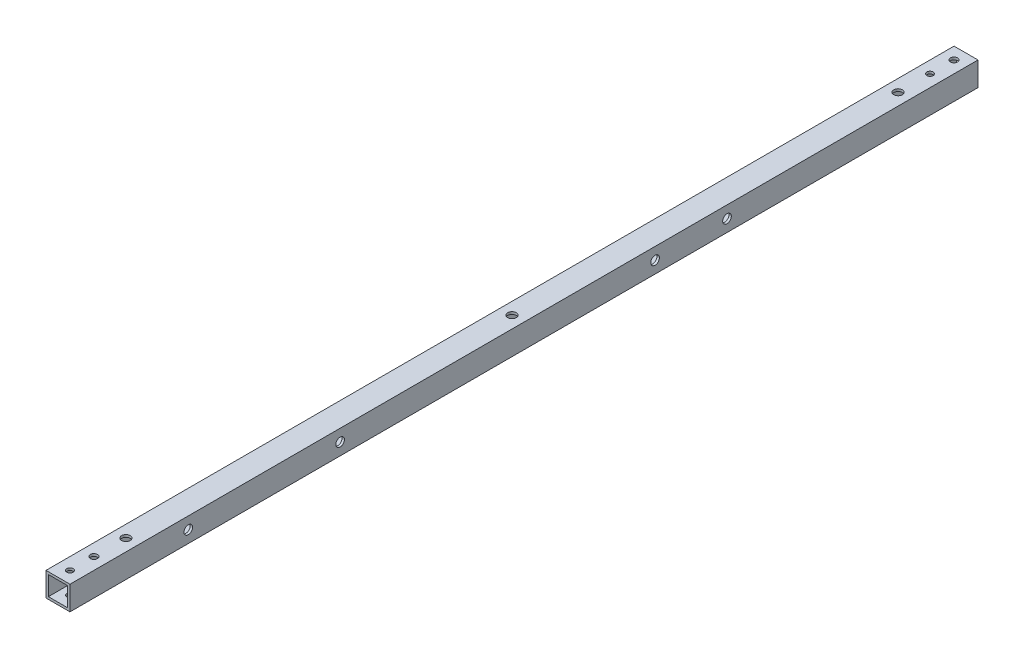
ISO-10303-21;
HEADER;
FILE_DESCRIPTION(('STEP AP214'),'2;1');
FILE_NAME('part.step','',(''),(''),'','','');
FILE_SCHEMA(('AUTOMOTIVE_DESIGN { 1 0 10303 214 1 1 1 1 }'));
ENDSEC;
DATA;
#1=APPLICATION_CONTEXT('core data for automotive mechanical design processes');
#2=APPLICATION_PROTOCOL_DEFINITION('international standard','automotive_design',2000,#1);
#3=PRODUCT_CONTEXT('',#1,'mechanical');
#4=PRODUCT('Part','Part','',(#3));
#5=PRODUCT_RELATED_PRODUCT_CATEGORY('part','',(#4));
#6=PRODUCT_DEFINITION_FORMATION('','',#4);
#7=PRODUCT_DEFINITION_CONTEXT('part definition',#1,'design');
#8=PRODUCT_DEFINITION('design','',#6,#7);
#9=PRODUCT_DEFINITION_SHAPE('','',#8);
#10=(LENGTH_UNIT() NAMED_UNIT(*) SI_UNIT(.MILLI.,.METRE.));
#11=(NAMED_UNIT(*) PLANE_ANGLE_UNIT() SI_UNIT($,.RADIAN.));
#12=(NAMED_UNIT(*) SI_UNIT($,.STERADIAN.) SOLID_ANGLE_UNIT());
#13=UNCERTAINTY_MEASURE_WITH_UNIT(LENGTH_MEASURE(1.E-05),#10,'distance_accuracy_value','');
#14=(GEOMETRIC_REPRESENTATION_CONTEXT(3) GLOBAL_UNCERTAINTY_ASSIGNED_CONTEXT((#13)) GLOBAL_UNIT_ASSIGNED_CONTEXT((#10,
#11,#12)) REPRESENTATION_CONTEXT('',''));
#15=CARTESIAN_POINT('',(0.,0.,0.));
#16=DIRECTION('',(0.,0.,1.));
#17=DIRECTION('',(1.,0.,0.));
#18=AXIS2_PLACEMENT_3D('',#15,#16,#17);
#19=CARTESIAN_POINT('',(-7.5,-7.5,568.));
#20=DIRECTION('',(0.,1.,0.));
#21=DIRECTION('',(0.,0.,1.));
#22=AXIS2_PLACEMENT_3D('',#19,#20,#21);
#23=PLANE('',#22);
#24=DIRECTION('',(1.,0.,0.));
#25=VECTOR('',#24,1.);
#26=CARTESIAN_POINT('',(-7.5,-7.5,0.));
#27=LINE('',#26,#25);
#28=CARTESIAN_POINT('',(-7.5,-7.5,0.));
#29=VERTEX_POINT('',#28);
#30=CARTESIAN_POINT('',(7.5,-7.5,0.));
#31=VERTEX_POINT('',#30);
#32=EDGE_CURVE('E151',#29,#31,#27,.T.);
#33=ORIENTED_EDGE('',*,*,#32,.T.);
#34=DIRECTION('',(0.,0.,-1.));
#35=VECTOR('',#34,1.);
#36=CARTESIAN_POINT('',(7.5,-7.5,568.));
#37=LINE('',#36,#35);
#38=CARTESIAN_POINT('',(7.5,-7.5,568.));
#39=VERTEX_POINT('',#38);
#40=EDGE_CURVE('E157',#39,#31,#37,.T.);
#41=ORIENTED_EDGE('',*,*,#40,.F.);
#42=DIRECTION('',(1.,0.,0.));
#43=VECTOR('',#42,1.);
#44=CARTESIAN_POINT('',(-7.5,-7.5,568.));
#45=LINE('',#44,#43);
#46=CARTESIAN_POINT('',(-7.5,-7.5,568.));
#47=VERTEX_POINT('',#46);
#48=EDGE_CURVE('E155',#47,#39,#45,.T.);
#49=ORIENTED_EDGE('',*,*,#48,.F.);
#50=DIRECTION('',(0.,0.,-1.));
#51=VECTOR('',#50,1.);
#52=CARTESIAN_POINT('',(-7.5,-7.5,568.));
#53=LINE('',#52,#51);
#54=EDGE_CURVE('E167',#47,#29,#53,.T.);
#55=ORIENTED_EDGE('',*,*,#54,.T.);
#56=EDGE_LOOP('',(#33,#41,#49,#55));
#57=FACE_BOUND('',#56,.T.);
#58=CARTESIAN_POINT('',(0.,-7.5,22.5));
#59=DIRECTION('',(0.,-1.,0.));
#60=DIRECTION('',(0.,0.,-1.));
#61=AXIS2_PLACEMENT_3D('',#58,#59,#60);
#62=CIRCLE('',#61,2.);
#63=CARTESIAN_POINT('',(0.,-7.5,20.5));
#64=VERTEX_POINT('',#63);
#65=EDGE_CURVE('E176',#64,#64,#62,.T.);
#66=ORIENTED_EDGE('',*,*,#65,.F.);
#67=EDGE_LOOP('',(#66));
#68=FACE_BOUND('',#67,.T.);
#69=CARTESIAN_POINT('',(0.,-7.5,7.5));
#70=DIRECTION('',(0.,-1.,0.));
#71=DIRECTION('',(0.,0.,-1.));
#72=AXIS2_PLACEMENT_3D('',#69,#70,#71);
#73=CIRCLE('',#72,2.25);
#74=CARTESIAN_POINT('',(0.,-7.5,5.25));
#75=VERTEX_POINT('',#74);
#76=EDGE_CURVE('E233',#75,#75,#73,.T.);
#77=ORIENTED_EDGE('',*,*,#76,.F.);
#78=EDGE_LOOP('',(#77));
#79=FACE_BOUND('',#78,.T.);
#80=CARTESIAN_POINT('',(-1.84548694605509E-12,-7.5,560.5));
#81=DIRECTION('',(0.,-1.,0.));
#82=DIRECTION('',(0.,0.,-1.));
#83=AXIS2_PLACEMENT_3D('',#80,#81,#82);
#84=CIRCLE('',#83,2.);
#85=CARTESIAN_POINT('',(-1.84548694605509E-12,-7.5,558.5));
#86=VERTEX_POINT('',#85);
#87=EDGE_CURVE('E232',#86,#86,#84,.T.);
#88=ORIENTED_EDGE('',*,*,#87,.F.);
#89=EDGE_LOOP('',(#88));
#90=FACE_BOUND('',#89,.T.);
#91=CARTESIAN_POINT('',(-1.84547396140054E-12,-7.5,545.5));
#92=DIRECTION('',(0.,-1.,0.));
#93=DIRECTION('',(0.,0.,-1.));
#94=AXIS2_PLACEMENT_3D('',#91,#92,#93);
#95=CIRCLE('',#94,2.24999999999998);
#96=CARTESIAN_POINT('',(-1.84547396140054E-12,-7.5,543.25));
#97=VERTEX_POINT('',#96);
#98=EDGE_CURVE('E229',#97,#97,#95,.T.);
#99=ORIENTED_EDGE('',*,*,#98,.F.);
#100=EDGE_LOOP('',(#99));
#101=FACE_BOUND('',#100,.T.);
#102=CARTESIAN_POINT('',(0.,-7.5,525.5));
#103=DIRECTION('',(0.,-1.,0.));
#104=DIRECTION('',(0.,0.,-1.));
#105=AXIS2_PLACEMENT_3D('',#102,#103,#104);
#106=CIRCLE('',#105,4.99999999999999);
#107=CARTESIAN_POINT('',(0.,-7.5,520.5));
#108=VERTEX_POINT('',#107);
#109=EDGE_CURVE('E465',#108,#108,#106,.T.);
#110=ORIENTED_EDGE('',*,*,#109,.F.);
#111=EDGE_LOOP('',(#110));
#112=FACE_BOUND('',#111,.T.);
#113=CARTESIAN_POINT('',(0.,-7.5,284.));
#114=DIRECTION('',(0.,-1.,0.));
#115=DIRECTION('',(0.,0.,-1.));
#116=AXIS2_PLACEMENT_3D('',#113,#114,#115);
#117=CIRCLE('',#116,4.99999999999999);
#118=CARTESIAN_POINT('',(0.,-7.5,279.));
#119=VERTEX_POINT('',#118);
#120=EDGE_CURVE('E457',#119,#119,#117,.T.);
#121=ORIENTED_EDGE('',*,*,#120,.F.);
#122=EDGE_LOOP('',(#121));
#123=FACE_BOUND('',#122,.T.);
#124=CARTESIAN_POINT('',(0.,-7.5,42.5));
#125=DIRECTION('',(0.,-1.,0.));
#126=DIRECTION('',(0.,0.,-1.));
#127=AXIS2_PLACEMENT_3D('',#124,#125,#126);
#128=CIRCLE('',#127,4.99999999999999);
#129=CARTESIAN_POINT('',(0.,-7.5,37.5));
#130=VERTEX_POINT('',#129);
#131=EDGE_CURVE('E454',#130,#130,#128,.T.);
#132=ORIENTED_EDGE('',*,*,#131,.F.);
#133=EDGE_LOOP('',(#132));
#134=FACE_BOUND('',#133,.T.);
#135=ADVANCED_FACE('F41',(#57,#68,#79,#90,#101,#112,#123,#134),#23,.F.);
#136=CARTESIAN_POINT('',(-6.,-6.,568.));
#137=DIRECTION('',(0.,1.,0.));
#138=DIRECTION('',(0.,0.,1.));
#139=AXIS2_PLACEMENT_3D('',#136,#137,#138);
#140=PLANE('',#139);
#141=CARTESIAN_POINT('',(0.,-6.,42.5));
#142=DIRECTION('',(0.,-1.,0.));
#143=DIRECTION('',(0.,0.,-1.));
#144=AXIS2_PLACEMENT_3D('',#141,#142,#143);
#145=CIRCLE('',#144,4.99999999999999);
#146=CARTESIAN_POINT('',(0.,-6.,37.5));
#147=VERTEX_POINT('',#146);
#148=EDGE_CURVE('E451',#147,#147,#145,.T.);
#149=ORIENTED_EDGE('',*,*,#148,.T.);
#150=EDGE_LOOP('',(#149));
#151=FACE_BOUND('',#150,.T.);
#152=DIRECTION('',(1.,0.,0.));
#153=VECTOR('',#152,1.);
#154=CARTESIAN_POINT('',(-6.,-6.,0.));
#155=LINE('',#154,#153);
#156=CARTESIAN_POINT('',(-6.,-6.,0.));
#157=VERTEX_POINT('',#156);
#158=CARTESIAN_POINT('',(6.,-6.,0.));
#159=VERTEX_POINT('',#158);
#160=EDGE_CURVE('E117',#157,#159,#155,.T.);
#161=ORIENTED_EDGE('',*,*,#160,.F.);
#162=DIRECTION('',(0.,0.,-1.));
#163=VECTOR('',#162,1.);
#164=CARTESIAN_POINT('',(-6.,-6.,568.));
#165=LINE('',#164,#163);
#166=CARTESIAN_POINT('',(-6.,-6.,568.));
#167=VERTEX_POINT('',#166);
#168=EDGE_CURVE('E58',#167,#157,#165,.T.);
#169=ORIENTED_EDGE('',*,*,#168,.F.);
#170=DIRECTION('',(1.,0.,0.));
#171=VECTOR('',#170,1.);
#172=CARTESIAN_POINT('',(-6.,-6.,568.));
#173=LINE('',#172,#171);
#174=CARTESIAN_POINT('',(6.,-6.,568.));
#175=VERTEX_POINT('',#174);
#176=EDGE_CURVE('E131',#167,#175,#173,.T.);
#177=ORIENTED_EDGE('',*,*,#176,.T.);
#178=DIRECTION('',(0.,0.,-1.));
#179=VECTOR('',#178,1.);
#180=CARTESIAN_POINT('',(6.,-6.,568.));
#181=LINE('',#180,#179);
#182=EDGE_CURVE('E112',#175,#159,#181,.T.);
#183=ORIENTED_EDGE('',*,*,#182,.T.);
#184=EDGE_LOOP('',(#161,#169,#177,#183));
#185=FACE_BOUND('',#184,.T.);
#186=CARTESIAN_POINT('',(0.,-6.,22.5));
#187=DIRECTION('',(0.,1.,0.));
#188=DIRECTION('',(0.,0.,1.));
#189=AXIS2_PLACEMENT_3D('',#186,#187,#188);
#190=CIRCLE('',#189,2.);
#191=CARTESIAN_POINT('',(0.,-6.,24.5));
#192=VERTEX_POINT('',#191);
#193=EDGE_CURVE('E172',#192,#192,#190,.T.);
#194=ORIENTED_EDGE('',*,*,#193,.F.);
#195=EDGE_LOOP('',(#194));
#196=FACE_BOUND('',#195,.T.);
#197=CARTESIAN_POINT('',(0.,-6.,7.5));
#198=DIRECTION('',(0.,1.,0.));
#199=DIRECTION('',(0.,0.,1.));
#200=AXIS2_PLACEMENT_3D('',#197,#198,#199);
#201=CIRCLE('',#200,2.25);
#202=CARTESIAN_POINT('',(0.,-6.,9.75));
#203=VERTEX_POINT('',#202);
#204=EDGE_CURVE('E177',#203,#203,#201,.T.);
#205=ORIENTED_EDGE('',*,*,#204,.F.);
#206=EDGE_LOOP('',(#205));
#207=FACE_BOUND('',#206,.T.);
#208=CARTESIAN_POINT('',(-1.84548694605509E-12,-6.,560.5));
#209=DIRECTION('',(0.,1.,0.));
#210=DIRECTION('',(0.,0.,1.));
#211=AXIS2_PLACEMENT_3D('',#208,#209,#210);
#212=CIRCLE('',#211,2.);
#213=CARTESIAN_POINT('',(-1.84548694605509E-12,-6.,562.5));
#214=VERTEX_POINT('',#213);
#215=EDGE_CURVE('E182',#214,#214,#212,.T.);
#216=ORIENTED_EDGE('',*,*,#215,.F.);
#217=EDGE_LOOP('',(#216));
#218=FACE_BOUND('',#217,.T.);
#219=CARTESIAN_POINT('',(-1.84547396140054E-12,-6.,545.5));
#220=DIRECTION('',(0.,1.,0.));
#221=DIRECTION('',(0.,0.,1.));
#222=AXIS2_PLACEMENT_3D('',#219,#220,#221);
#223=CIRCLE('',#222,2.24999999999998);
#224=CARTESIAN_POINT('',(-1.84547396140054E-12,-6.,547.75));
#225=VERTEX_POINT('',#224);
#226=EDGE_CURVE('E187',#225,#225,#223,.T.);
#227=ORIENTED_EDGE('',*,*,#226,.F.);
#228=EDGE_LOOP('',(#227));
#229=FACE_BOUND('',#228,.T.);
#230=CARTESIAN_POINT('',(0.,-6.,525.5));
#231=DIRECTION('',(0.,-1.,0.));
#232=DIRECTION('',(0.,0.,-1.));
#233=AXIS2_PLACEMENT_3D('',#230,#231,#232);
#234=CIRCLE('',#233,4.99999999999999);
#235=CARTESIAN_POINT('',(0.,-6.,520.5));
#236=VERTEX_POINT('',#235);
#237=EDGE_CURVE('E468',#236,#236,#234,.T.);
#238=ORIENTED_EDGE('',*,*,#237,.T.);
#239=EDGE_LOOP('',(#238));
#240=FACE_BOUND('',#239,.T.);
#241=CARTESIAN_POINT('',(0.,-6.,284.));
#242=DIRECTION('',(0.,-1.,0.));
#243=DIRECTION('',(0.,0.,-1.));
#244=AXIS2_PLACEMENT_3D('',#241,#242,#243);
#245=CIRCLE('',#244,4.99999999999999);
#246=CARTESIAN_POINT('',(0.,-6.,279.));
#247=VERTEX_POINT('',#246);
#248=EDGE_CURVE('E462',#247,#247,#245,.T.);
#249=ORIENTED_EDGE('',*,*,#248,.T.);
#250=EDGE_LOOP('',(#249));
#251=FACE_BOUND('',#250,.T.);
#252=ADVANCED_FACE('F297',(#151,#185,#196,#207,#218,#229,#240,#251),#140,.T.);
#253=CARTESIAN_POINT('',(0.,0.,568.));
#254=DIRECTION('',(0.,0.,-1.));
#255=DIRECTION('',(-1.,0.,0.));
#256=AXIS2_PLACEMENT_3D('',#253,#254,#255);
#257=PLANE('',#256);
#258=DIRECTION('',(0.,1.,0.));
#259=VECTOR('',#258,1.);
#260=CARTESIAN_POINT('',(7.5,-7.5,568.));
#261=LINE('',#260,#259);
#262=CARTESIAN_POINT('',(7.5,7.5,568.));
#263=VERTEX_POINT('',#262);
#264=EDGE_CURVE('E147',#39,#263,#261,.T.);
#265=ORIENTED_EDGE('',*,*,#264,.T.);
#266=DIRECTION('',(-1.,0.,0.));
#267=VECTOR('',#266,1.);
#268=CARTESIAN_POINT('',(-7.5,7.5,568.));
#269=LINE('',#268,#267);
#270=CARTESIAN_POINT('',(-7.5,7.5,568.));
#271=VERTEX_POINT('',#270);
#272=EDGE_CURVE('E150',#263,#271,#269,.T.);
#273=ORIENTED_EDGE('',*,*,#272,.T.);
#274=DIRECTION('',(0.,-1.,0.));
#275=VECTOR('',#274,1.);
#276=CARTESIAN_POINT('',(-7.5,-7.5,568.));
#277=LINE('',#276,#275);
#278=EDGE_CURVE('E153',#271,#47,#277,.T.);
#279=ORIENTED_EDGE('',*,*,#278,.T.);
#280=ORIENTED_EDGE('',*,*,#48,.T.);
#281=EDGE_LOOP('',(#265,#273,#279,#280));
#282=FACE_BOUND('',#281,.T.);
#283=DIRECTION('',(0.,1.,0.));
#284=VECTOR('',#283,1.);
#285=CARTESIAN_POINT('',(6.,-6.,568.));
#286=LINE('',#285,#284);
#287=CARTESIAN_POINT('',(6.,6.,568.));
#288=VERTEX_POINT('',#287);
#289=EDGE_CURVE('E108',#175,#288,#286,.T.);
#290=ORIENTED_EDGE('',*,*,#289,.F.);
#291=ORIENTED_EDGE('',*,*,#176,.F.);
#292=DIRECTION('',(0.,-1.,0.));
#293=VECTOR('',#292,1.);
#294=CARTESIAN_POINT('',(-6.,-6.,568.));
#295=LINE('',#294,#293);
#296=CARTESIAN_POINT('',(-6.,6.,568.));
#297=VERTEX_POINT('',#296);
#298=EDGE_CURVE('E129',#297,#167,#295,.T.);
#299=ORIENTED_EDGE('',*,*,#298,.F.);
#300=DIRECTION('',(-1.,0.,0.));
#301=VECTOR('',#300,1.);
#302=CARTESIAN_POINT('',(-6.,6.,568.));
#303=LINE('',#302,#301);
#304=EDGE_CURVE('E116',#288,#297,#303,.T.);
#305=ORIENTED_EDGE('',*,*,#304,.F.);
#306=EDGE_LOOP('',(#290,#291,#299,#305));
#307=FACE_BOUND('',#306,.T.);
#308=ADVANCED_FACE('F128',(#282,#307),#257,.F.);
#309=CARTESIAN_POINT('',(0.,0.,0.));
#310=DIRECTION('',(0.,0.,-1.));
#311=DIRECTION('',(-1.,0.,0.));
#312=AXIS2_PLACEMENT_3D('',#309,#310,#311);
#313=PLANE('',#312);
#314=DIRECTION('',(0.,1.,0.));
#315=VECTOR('',#314,1.);
#316=CARTESIAN_POINT('',(7.5,-7.5,0.));
#317=LINE('',#316,#315);
#318=CARTESIAN_POINT('',(7.5,7.5,0.));
#319=VERTEX_POINT('',#318);
#320=EDGE_CURVE('E124',#31,#319,#317,.T.);
#321=ORIENTED_EDGE('',*,*,#320,.F.);
#322=ORIENTED_EDGE('',*,*,#32,.F.);
#323=DIRECTION('',(0.,-1.,0.));
#324=VECTOR('',#323,1.);
#325=CARTESIAN_POINT('',(-7.5,-7.5,0.));
#326=LINE('',#325,#324);
#327=CARTESIAN_POINT('',(-7.5,7.5,0.));
#328=VERTEX_POINT('',#327);
#329=EDGE_CURVE('E162',#328,#29,#326,.T.);
#330=ORIENTED_EDGE('',*,*,#329,.F.);
#331=DIRECTION('',(-1.,0.,0.));
#332=VECTOR('',#331,1.);
#333=CARTESIAN_POINT('',(-7.5,7.5,0.));
#334=LINE('',#333,#332);
#335=EDGE_CURVE('E160',#319,#328,#334,.T.);
#336=ORIENTED_EDGE('',*,*,#335,.F.);
#337=EDGE_LOOP('',(#321,#322,#330,#336));
#338=FACE_BOUND('',#337,.T.);
#339=ORIENTED_EDGE('',*,*,#160,.T.);
#340=DIRECTION('',(0.,1.,0.));
#341=VECTOR('',#340,1.);
#342=CARTESIAN_POINT('',(6.,-6.,0.));
#343=LINE('',#342,#341);
#344=CARTESIAN_POINT('',(6.,6.,0.));
#345=VERTEX_POINT('',#344);
#346=EDGE_CURVE('E66',#159,#345,#343,.T.);
#347=ORIENTED_EDGE('',*,*,#346,.T.);
#348=DIRECTION('',(-1.,0.,0.));
#349=VECTOR('',#348,1.);
#350=CARTESIAN_POINT('',(-6.,6.,0.));
#351=LINE('',#350,#349);
#352=CARTESIAN_POINT('',(-6.,6.,0.));
#353=VERTEX_POINT('',#352);
#354=EDGE_CURVE('E123',#345,#353,#351,.T.);
#355=ORIENTED_EDGE('',*,*,#354,.T.);
#356=DIRECTION('',(0.,-1.,0.));
#357=VECTOR('',#356,1.);
#358=CARTESIAN_POINT('',(-6.,-6.,0.));
#359=LINE('',#358,#357);
#360=EDGE_CURVE('E139',#353,#157,#359,.T.);
#361=ORIENTED_EDGE('',*,*,#360,.T.);
#362=EDGE_LOOP('',(#339,#347,#355,#361));
#363=FACE_BOUND('',#362,.T.);
#364=ADVANCED_FACE('F309',(#338,#363),#313,.T.);
#365=CARTESIAN_POINT('',(7.5,-7.5,568.));
#366=DIRECTION('',(-1.,0.,0.));
#367=DIRECTION('',(0.,0.,1.));
#368=AXIS2_PLACEMENT_3D('',#365,#366,#367);
#369=PLANE('',#368);
#370=CARTESIAN_POINT('',(7.5,0.,494.));
#371=DIRECTION('',(1.,0.,0.));
#372=DIRECTION('',(0.,0.,-1.));
#373=AXIS2_PLACEMENT_3D('',#370,#371,#372);
#374=CIRCLE('',#373,2.69999999999996);
#375=CARTESIAN_POINT('',(7.5,0.,491.3));
#376=VERTEX_POINT('',#375);
#377=EDGE_CURVE('E220',#376,#376,#374,.T.);
#378=ORIENTED_EDGE('',*,*,#377,.F.);
#379=EDGE_LOOP('',(#378));
#380=FACE_BOUND('',#379,.T.);
#381=CARTESIAN_POINT('',(7.5,0.,399.));
#382=DIRECTION('',(1.,0.,0.));
#383=DIRECTION('',(0.,0.,-1.));
#384=AXIS2_PLACEMENT_3D('',#381,#382,#383);
#385=CIRCLE('',#384,2.69999999999996);
#386=CARTESIAN_POINT('',(7.5,0.,396.3));
#387=VERTEX_POINT('',#386);
#388=EDGE_CURVE('E212',#387,#387,#385,.T.);
#389=ORIENTED_EDGE('',*,*,#388,.F.);
#390=EDGE_LOOP('',(#389));
#391=FACE_BOUND('',#390,.T.);
#392=CARTESIAN_POINT('',(7.5,0.,202.));
#393=DIRECTION('',(1.,0.,0.));
#394=DIRECTION('',(0.,0.,-1.));
#395=AXIS2_PLACEMENT_3D('',#392,#393,#394);
#396=CIRCLE('',#395,2.70000000000001);
#397=CARTESIAN_POINT('',(7.5,0.,199.3));
#398=VERTEX_POINT('',#397);
#399=EDGE_CURVE('E207',#398,#398,#396,.T.);
#400=ORIENTED_EDGE('',*,*,#399,.F.);
#401=EDGE_LOOP('',(#400));
#402=FACE_BOUND('',#401,.T.);
#403=CARTESIAN_POINT('',(7.5,0.,157.));
#404=DIRECTION('',(1.,0.,0.));
#405=DIRECTION('',(0.,0.,-1.));
#406=AXIS2_PLACEMENT_3D('',#403,#404,#405);
#407=CIRCLE('',#406,2.70000000000001);
#408=CARTESIAN_POINT('',(7.5,0.,154.3));
#409=VERTEX_POINT('',#408);
#410=EDGE_CURVE('E203',#409,#409,#407,.T.);
#411=ORIENTED_EDGE('',*,*,#410,.F.);
#412=EDGE_LOOP('',(#411));
#413=FACE_BOUND('',#412,.T.);
#414=ORIENTED_EDGE('',*,*,#320,.T.);
#415=DIRECTION('',(0.,0.,-1.));
#416=VECTOR('',#415,1.);
#417=CARTESIAN_POINT('',(7.5,7.5,568.));
#418=LINE('',#417,#416);
#419=EDGE_CURVE('E11',#263,#319,#418,.T.);
#420=ORIENTED_EDGE('',*,*,#419,.F.);
#421=ORIENTED_EDGE('',*,*,#264,.F.);
#422=ORIENTED_EDGE('',*,*,#40,.T.);
#423=EDGE_LOOP('',(#414,#420,#421,#422));
#424=FACE_BOUND('',#423,.T.);
#425=ADVANCED_FACE('F43',(#380,#391,#402,#413,#424),#369,.F.);
#426=CARTESIAN_POINT('',(-7.5,7.5,568.));
#427=DIRECTION('',(0.,-1.,0.));
#428=DIRECTION('',(0.,0.,-1.));
#429=AXIS2_PLACEMENT_3D('',#426,#427,#428);
#430=PLANE('',#429);
#431=CARTESIAN_POINT('',(0.,7.5,42.5));
#432=DIRECTION('',(0.,-1.,0.));
#433=DIRECTION('',(0.,0.,-1.));
#434=AXIS2_PLACEMENT_3D('',#431,#432,#433);
#435=CIRCLE('',#434,2.7);
#436=CARTESIAN_POINT('',(0.,7.5,39.8));
#437=VERTEX_POINT('',#436);
#438=EDGE_CURVE('E137',#437,#437,#435,.T.);
#439=ORIENTED_EDGE('',*,*,#438,.T.);
#440=EDGE_LOOP('',(#439));
#441=FACE_BOUND('',#440,.T.);
#442=CARTESIAN_POINT('',(-1.84547396140054E-12,7.5,545.5));
#443=DIRECTION('',(0.,-1.,0.));
#444=DIRECTION('',(0.,0.,-1.));
#445=AXIS2_PLACEMENT_3D('',#442,#443,#444);
#446=CIRCLE('',#445,2.24999999999998);
#447=CARTESIAN_POINT('',(-1.84547396140054E-12,7.5,543.25));
#448=VERTEX_POINT('',#447);
#449=EDGE_CURVE('E266',#448,#448,#446,.T.);
#450=ORIENTED_EDGE('',*,*,#449,.T.);
#451=EDGE_LOOP('',(#450));
#452=FACE_BOUND('',#451,.T.);
#453=CARTESIAN_POINT('',(-1.84548694605509E-12,7.5,560.5));
#454=DIRECTION('',(0.,-1.,0.));
#455=DIRECTION('',(0.,0.,-1.));
#456=AXIS2_PLACEMENT_3D('',#453,#454,#455);
#457=CIRCLE('',#456,2.);
#458=CARTESIAN_POINT('',(-1.84548694605509E-12,7.5,558.5));
#459=VERTEX_POINT('',#458);
#460=EDGE_CURVE('E191',#459,#459,#457,.T.);
#461=ORIENTED_EDGE('',*,*,#460,.T.);
#462=EDGE_LOOP('',(#461));
#463=FACE_BOUND('',#462,.T.);
#464=CARTESIAN_POINT('',(0.,7.5,7.5));
#465=DIRECTION('',(0.,-1.,0.));
#466=DIRECTION('',(0.,0.,-1.));
#467=AXIS2_PLACEMENT_3D('',#464,#465,#466);
#468=CIRCLE('',#467,2.25);
#469=CARTESIAN_POINT('',(0.,7.5,5.25));
#470=VERTEX_POINT('',#469);
#471=EDGE_CURVE('E186',#470,#470,#468,.T.);
#472=ORIENTED_EDGE('',*,*,#471,.T.);
#473=EDGE_LOOP('',(#472));
#474=FACE_BOUND('',#473,.T.);
#475=CARTESIAN_POINT('',(0.,7.5,284.));
#476=DIRECTION('',(0.,-1.,0.));
#477=DIRECTION('',(0.,0.,-1.));
#478=AXIS2_PLACEMENT_3D('',#475,#476,#477);
#479=CIRCLE('',#478,2.69999999999999);
#480=CARTESIAN_POINT('',(0.,7.5,281.3));
#481=VERTEX_POINT('',#480);
#482=EDGE_CURVE('E181',#481,#481,#479,.T.);
#483=ORIENTED_EDGE('',*,*,#482,.T.);
#484=EDGE_LOOP('',(#483));
#485=FACE_BOUND('',#484,.T.);
#486=CARTESIAN_POINT('',(0.,7.5,525.5));
#487=DIRECTION('',(0.,-1.,0.));
#488=DIRECTION('',(0.,0.,-1.));
#489=AXIS2_PLACEMENT_3D('',#486,#487,#488);
#490=CIRCLE('',#489,2.69999999999999);
#491=CARTESIAN_POINT('',(0.,7.5,522.8));
#492=VERTEX_POINT('',#491);
#493=EDGE_CURVE('E248',#492,#492,#490,.T.);
#494=ORIENTED_EDGE('',*,*,#493,.T.);
#495=EDGE_LOOP('',(#494));
#496=FACE_BOUND('',#495,.T.);
#497=CARTESIAN_POINT('',(0.,7.5,22.5));
#498=DIRECTION('',(0.,-1.,0.));
#499=DIRECTION('',(0.,0.,-1.));
#500=AXIS2_PLACEMENT_3D('',#497,#498,#499);
#501=CIRCLE('',#500,2.);
#502=CARTESIAN_POINT('',(0.,7.5,20.5));
#503=VERTEX_POINT('',#502);
#504=EDGE_CURVE('E242',#503,#503,#501,.T.);
#505=ORIENTED_EDGE('',*,*,#504,.T.);
#506=EDGE_LOOP('',(#505));
#507=FACE_BOUND('',#506,.T.);
#508=ORIENTED_EDGE('',*,*,#335,.T.);
#509=DIRECTION('',(0.,0.,-1.));
#510=VECTOR('',#509,1.);
#511=CARTESIAN_POINT('',(-7.5,7.5,568.));
#512=LINE('',#511,#510);
#513=EDGE_CURVE('E50',#271,#328,#512,.T.);
#514=ORIENTED_EDGE('',*,*,#513,.F.);
#515=ORIENTED_EDGE('',*,*,#272,.F.);
#516=ORIENTED_EDGE('',*,*,#419,.T.);
#517=EDGE_LOOP('',(#508,#514,#515,#516));
#518=FACE_BOUND('',#517,.T.);
#519=ADVANCED_FACE('F274',(#441,#452,#463,#474,#485,#496,#507,#518),#430,.F.);
#520=CARTESIAN_POINT('',(-7.5,-7.5,568.));
#521=DIRECTION('',(1.,0.,0.));
#522=DIRECTION('',(0.,0.,-1.));
#523=AXIS2_PLACEMENT_3D('',#520,#521,#522);
#524=PLANE('',#523);
#525=CARTESIAN_POINT('',(-7.5,0.,157.));
#526=DIRECTION('',(-1.,0.,0.));
#527=DIRECTION('',(0.,0.,1.));
#528=AXIS2_PLACEMENT_3D('',#525,#526,#527);
#529=CIRCLE('',#528,4.99999999999999);
#530=CARTESIAN_POINT('',(-7.5,0.,162.));
#531=VERTEX_POINT('',#530);
#532=EDGE_CURVE('E196',#531,#531,#529,.T.);
#533=ORIENTED_EDGE('',*,*,#532,.F.);
#534=EDGE_LOOP('',(#533));
#535=FACE_BOUND('',#534,.T.);
#536=CARTESIAN_POINT('',(-7.5,0.,202.));
#537=DIRECTION('',(-1.,0.,0.));
#538=DIRECTION('',(0.,0.,1.));
#539=AXIS2_PLACEMENT_3D('',#536,#537,#538);
#540=CIRCLE('',#539,4.99999999999999);
#541=CARTESIAN_POINT('',(-7.5,0.,207.));
#542=VERTEX_POINT('',#541);
#543=EDGE_CURVE('E474',#542,#542,#540,.T.);
#544=ORIENTED_EDGE('',*,*,#543,.F.);
#545=EDGE_LOOP('',(#544));
#546=FACE_BOUND('',#545,.T.);
#547=CARTESIAN_POINT('',(-7.5,0.,399.));
#548=DIRECTION('',(-1.,0.,0.));
#549=DIRECTION('',(0.,0.,1.));
#550=AXIS2_PLACEMENT_3D('',#547,#548,#549);
#551=CIRCLE('',#550,4.99999999999999);
#552=CARTESIAN_POINT('',(-7.5,0.,404.));
#553=VERTEX_POINT('',#552);
#554=EDGE_CURVE('E477',#553,#553,#551,.T.);
#555=ORIENTED_EDGE('',*,*,#554,.F.);
#556=EDGE_LOOP('',(#555));
#557=FACE_BOUND('',#556,.T.);
#558=CARTESIAN_POINT('',(-7.5,0.,494.));
#559=DIRECTION('',(-1.,0.,0.));
#560=DIRECTION('',(0.,0.,1.));
#561=AXIS2_PLACEMENT_3D('',#558,#559,#560);
#562=CIRCLE('',#561,4.99999999999999);
#563=CARTESIAN_POINT('',(-7.5,0.,499.));
#564=VERTEX_POINT('',#563);
#565=EDGE_CURVE('E471',#564,#564,#562,.T.);
#566=ORIENTED_EDGE('',*,*,#565,.F.);
#567=EDGE_LOOP('',(#566));
#568=FACE_BOUND('',#567,.T.);
#569=ORIENTED_EDGE('',*,*,#329,.T.);
#570=ORIENTED_EDGE('',*,*,#54,.F.);
#571=ORIENTED_EDGE('',*,*,#278,.F.);
#572=ORIENTED_EDGE('',*,*,#513,.T.);
#573=EDGE_LOOP('',(#569,#570,#571,#572));
#574=FACE_BOUND('',#573,.T.);
#575=ADVANCED_FACE('F311',(#535,#546,#557,#568,#574),#524,.F.);
#576=CARTESIAN_POINT('',(6.,-6.,568.));
#577=DIRECTION('',(-1.,0.,0.));
#578=DIRECTION('',(0.,0.,1.));
#579=AXIS2_PLACEMENT_3D('',#576,#577,#578);
#580=PLANE('',#579);
#581=CARTESIAN_POINT('',(6.,0.,494.));
#582=DIRECTION('',(-1.,0.,0.));
#583=DIRECTION('',(0.,0.,1.));
#584=AXIS2_PLACEMENT_3D('',#581,#582,#583);
#585=CIRCLE('',#584,2.69999999999996);
#586=CARTESIAN_POINT('',(6.,0.,496.7));
#587=VERTEX_POINT('',#586);
#588=EDGE_CURVE('E226',#587,#587,#585,.T.);
#589=ORIENTED_EDGE('',*,*,#588,.F.);
#590=EDGE_LOOP('',(#589));
#591=FACE_BOUND('',#590,.T.);
#592=CARTESIAN_POINT('',(6.,0.,399.));
#593=DIRECTION('',(-1.,0.,0.));
#594=DIRECTION('',(0.,0.,1.));
#595=AXIS2_PLACEMENT_3D('',#592,#593,#594);
#596=CIRCLE('',#595,2.69999999999996);
#597=CARTESIAN_POINT('',(6.,0.,401.7));
#598=VERTEX_POINT('',#597);
#599=EDGE_CURVE('E223',#598,#598,#596,.T.);
#600=ORIENTED_EDGE('',*,*,#599,.F.);
#601=EDGE_LOOP('',(#600));
#602=FACE_BOUND('',#601,.T.);
#603=CARTESIAN_POINT('',(6.,0.,202.));
#604=DIRECTION('',(-1.,0.,0.));
#605=DIRECTION('',(0.,0.,1.));
#606=AXIS2_PLACEMENT_3D('',#603,#604,#605);
#607=CIRCLE('',#606,2.70000000000001);
#608=CARTESIAN_POINT('',(6.,0.,204.7));
#609=VERTEX_POINT('',#608);
#610=EDGE_CURVE('E219',#609,#609,#607,.T.);
#611=ORIENTED_EDGE('',*,*,#610,.F.);
#612=EDGE_LOOP('',(#611));
#613=FACE_BOUND('',#612,.T.);
#614=CARTESIAN_POINT('',(6.,0.,157.));
#615=DIRECTION('',(-1.,0.,0.));
#616=DIRECTION('',(0.,0.,1.));
#617=AXIS2_PLACEMENT_3D('',#614,#615,#616);
#618=CIRCLE('',#617,2.70000000000001);
#619=CARTESIAN_POINT('',(6.,0.,159.7));
#620=VERTEX_POINT('',#619);
#621=EDGE_CURVE('E216',#620,#620,#618,.T.);
#622=ORIENTED_EDGE('',*,*,#621,.F.);
#623=EDGE_LOOP('',(#622));
#624=FACE_BOUND('',#623,.T.);
#625=ORIENTED_EDGE('',*,*,#346,.F.);
#626=ORIENTED_EDGE('',*,*,#182,.F.);
#627=ORIENTED_EDGE('',*,*,#289,.T.);
#628=DIRECTION('',(0.,0.,-1.));
#629=VECTOR('',#628,1.);
#630=CARTESIAN_POINT('',(6.,6.,568.));
#631=LINE('',#630,#629);
#632=EDGE_CURVE('E111',#288,#345,#631,.T.);
#633=ORIENTED_EDGE('',*,*,#632,.T.);
#634=EDGE_LOOP('',(#625,#626,#627,#633));
#635=FACE_BOUND('',#634,.T.);
#636=ADVANCED_FACE('F110',(#591,#602,#613,#624,#635),#580,.T.);
#637=CARTESIAN_POINT('',(-6.,6.,568.));
#638=DIRECTION('',(0.,-1.,0.));
#639=DIRECTION('',(0.,0.,-1.));
#640=AXIS2_PLACEMENT_3D('',#637,#638,#639);
#641=PLANE('',#640);
#642=CARTESIAN_POINT('',(0.,6.,42.5));
#643=DIRECTION('',(0.,-1.,0.));
#644=DIRECTION('',(0.,0.,-1.));
#645=AXIS2_PLACEMENT_3D('',#642,#643,#644);
#646=CIRCLE('',#645,2.7);
#647=CARTESIAN_POINT('',(0.,6.,39.8));
#648=VERTEX_POINT('',#647);
#649=EDGE_CURVE('E269',#648,#648,#646,.T.);
#650=ORIENTED_EDGE('',*,*,#649,.F.);
#651=EDGE_LOOP('',(#650));
#652=FACE_BOUND('',#651,.T.);
#653=CARTESIAN_POINT('',(-1.84547396140054E-12,6.,545.5));
#654=DIRECTION('',(0.,-1.,0.));
#655=DIRECTION('',(0.,0.,-1.));
#656=AXIS2_PLACEMENT_3D('',#653,#654,#655);
#657=CIRCLE('',#656,2.24999999999998);
#658=CARTESIAN_POINT('',(-1.84547396140054E-12,6.,543.25));
#659=VERTEX_POINT('',#658);
#660=EDGE_CURVE('E190',#659,#659,#657,.T.);
#661=ORIENTED_EDGE('',*,*,#660,.F.);
#662=EDGE_LOOP('',(#661));
#663=FACE_BOUND('',#662,.T.);
#664=CARTESIAN_POINT('',(-1.84548694605509E-12,6.,560.5));
#665=DIRECTION('',(0.,-1.,0.));
#666=DIRECTION('',(0.,0.,-1.));
#667=AXIS2_PLACEMENT_3D('',#664,#665,#666);
#668=CIRCLE('',#667,2.);
#669=CARTESIAN_POINT('',(-1.84548694605509E-12,6.,558.5));
#670=VERTEX_POINT('',#669);
#671=EDGE_CURVE('E185',#670,#670,#668,.T.);
#672=ORIENTED_EDGE('',*,*,#671,.F.);
#673=EDGE_LOOP('',(#672));
#674=FACE_BOUND('',#673,.T.);
#675=CARTESIAN_POINT('',(0.,6.,7.5));
#676=DIRECTION('',(0.,-1.,0.));
#677=DIRECTION('',(0.,0.,-1.));
#678=AXIS2_PLACEMENT_3D('',#675,#676,#677);
#679=CIRCLE('',#678,2.25);
#680=CARTESIAN_POINT('',(0.,6.,5.25));
#681=VERTEX_POINT('',#680);
#682=EDGE_CURVE('E180',#681,#681,#679,.T.);
#683=ORIENTED_EDGE('',*,*,#682,.F.);
#684=EDGE_LOOP('',(#683));
#685=FACE_BOUND('',#684,.T.);
#686=CARTESIAN_POINT('',(0.,6.,284.));
#687=DIRECTION('',(0.,-1.,0.));
#688=DIRECTION('',(0.,0.,-1.));
#689=AXIS2_PLACEMENT_3D('',#686,#687,#688);
#690=CIRCLE('',#689,2.69999999999999);
#691=CARTESIAN_POINT('',(0.,6.,281.3));
#692=VERTEX_POINT('',#691);
#693=EDGE_CURVE('E251',#692,#692,#690,.T.);
#694=ORIENTED_EDGE('',*,*,#693,.F.);
#695=EDGE_LOOP('',(#694));
#696=FACE_BOUND('',#695,.T.);
#697=CARTESIAN_POINT('',(0.,6.,525.5));
#698=DIRECTION('',(0.,-1.,0.));
#699=DIRECTION('',(0.,0.,-1.));
#700=AXIS2_PLACEMENT_3D('',#697,#698,#699);
#701=CIRCLE('',#700,2.69999999999999);
#702=CARTESIAN_POINT('',(0.,6.,522.8));
#703=VERTEX_POINT('',#702);
#704=EDGE_CURVE('E245',#703,#703,#701,.T.);
#705=ORIENTED_EDGE('',*,*,#704,.F.);
#706=EDGE_LOOP('',(#705));
#707=FACE_BOUND('',#706,.T.);
#708=CARTESIAN_POINT('',(0.,6.,22.5));
#709=DIRECTION('',(0.,-1.,0.));
#710=DIRECTION('',(0.,0.,-1.));
#711=AXIS2_PLACEMENT_3D('',#708,#709,#710);
#712=CIRCLE('',#711,2.);
#713=CARTESIAN_POINT('',(0.,6.,20.5));
#714=VERTEX_POINT('',#713);
#715=EDGE_CURVE('E175',#714,#714,#712,.T.);
#716=ORIENTED_EDGE('',*,*,#715,.F.);
#717=EDGE_LOOP('',(#716));
#718=FACE_BOUND('',#717,.T.);
#719=ORIENTED_EDGE('',*,*,#354,.F.);
#720=ORIENTED_EDGE('',*,*,#632,.F.);
#721=ORIENTED_EDGE('',*,*,#304,.T.);
#722=DIRECTION('',(0.,0.,-1.));
#723=VECTOR('',#722,1.);
#724=CARTESIAN_POINT('',(-6.,6.,568.));
#725=LINE('',#724,#723);
#726=EDGE_CURVE('E125',#297,#353,#725,.T.);
#727=ORIENTED_EDGE('',*,*,#726,.T.);
#728=EDGE_LOOP('',(#719,#720,#721,#727));
#729=FACE_BOUND('',#728,.T.);
#730=ADVANCED_FACE('F120',(#652,#663,#674,#685,#696,#707,#718,#729),#641,.T.);
#731=CARTESIAN_POINT('',(-6.,-6.,568.));
#732=DIRECTION('',(1.,0.,0.));
#733=DIRECTION('',(0.,0.,-1.));
#734=AXIS2_PLACEMENT_3D('',#731,#732,#733);
#735=PLANE('',#734);
#736=CARTESIAN_POINT('',(-6.,0.,157.));
#737=DIRECTION('',(1.,0.,0.));
#738=DIRECTION('',(0.,0.,-1.));
#739=AXIS2_PLACEMENT_3D('',#736,#737,#738);
#740=CIRCLE('',#739,4.99999999999999);
#741=CARTESIAN_POINT('',(-6.,0.,152.));
#742=VERTEX_POINT('',#741);
#743=EDGE_CURVE('E45',#742,#742,#740,.T.);
#744=ORIENTED_EDGE('',*,*,#743,.F.);
#745=EDGE_LOOP('',(#744));
#746=FACE_BOUND('',#745,.T.);
#747=CARTESIAN_POINT('',(-6.,0.,202.));
#748=DIRECTION('',(1.,0.,0.));
#749=DIRECTION('',(0.,0.,-1.));
#750=AXIS2_PLACEMENT_3D('',#747,#748,#749);
#751=CIRCLE('',#750,4.99999999999999);
#752=CARTESIAN_POINT('',(-6.,0.,197.));
#753=VERTEX_POINT('',#752);
#754=EDGE_CURVE('E198',#753,#753,#751,.T.);
#755=ORIENTED_EDGE('',*,*,#754,.F.);
#756=EDGE_LOOP('',(#755));
#757=FACE_BOUND('',#756,.T.);
#758=CARTESIAN_POINT('',(-6.,0.,399.));
#759=DIRECTION('',(1.,0.,0.));
#760=DIRECTION('',(0.,0.,-1.));
#761=AXIS2_PLACEMENT_3D('',#758,#759,#760);
#762=CIRCLE('',#761,4.99999999999999);
#763=CARTESIAN_POINT('',(-6.,0.,394.));
#764=VERTEX_POINT('',#763);
#765=EDGE_CURVE('E195',#764,#764,#762,.T.);
#766=ORIENTED_EDGE('',*,*,#765,.F.);
#767=EDGE_LOOP('',(#766));
#768=FACE_BOUND('',#767,.T.);
#769=CARTESIAN_POINT('',(-6.,0.,494.));
#770=DIRECTION('',(1.,0.,0.));
#771=DIRECTION('',(0.,0.,-1.));
#772=AXIS2_PLACEMENT_3D('',#769,#770,#771);
#773=CIRCLE('',#772,4.99999999999999);
#774=CARTESIAN_POINT('',(-6.,0.,489.));
#775=VERTEX_POINT('',#774);
#776=EDGE_CURVE('E192',#775,#775,#773,.T.);
#777=ORIENTED_EDGE('',*,*,#776,.F.);
#778=EDGE_LOOP('',(#777));
#779=FACE_BOUND('',#778,.T.);
#780=ORIENTED_EDGE('',*,*,#360,.F.);
#781=ORIENTED_EDGE('',*,*,#726,.F.);
#782=ORIENTED_EDGE('',*,*,#298,.T.);
#783=ORIENTED_EDGE('',*,*,#168,.T.);
#784=EDGE_LOOP('',(#780,#781,#782,#783));
#785=FACE_BOUND('',#784,.T.);
#786=ADVANCED_FACE('F354',(#746,#757,#768,#779,#785),#735,.T.);
#787=CARTESIAN_POINT('',(0.,12.5,22.5));
#788=DIRECTION('',(0.,-1.,0.));
#789=DIRECTION('',(0.,0.,-1.));
#790=AXIS2_PLACEMENT_3D('',#787,#788,#789);
#791=CYLINDRICAL_SURFACE('',#790,2.);
#792=ORIENTED_EDGE('',*,*,#193,.T.);
#793=EDGE_LOOP('',(#792));
#794=FACE_BOUND('',#793,.T.);
#795=ORIENTED_EDGE('',*,*,#65,.T.);
#796=EDGE_LOOP('',(#795));
#797=FACE_BOUND('',#796,.T.);
#798=ADVANCED_FACE('F357',(#794,#797),#791,.F.);
#799=CARTESIAN_POINT('',(0.,12.5,7.5));
#800=DIRECTION('',(0.,-1.,0.));
#801=DIRECTION('',(0.,0.,-1.));
#802=AXIS2_PLACEMENT_3D('',#799,#800,#801);
#803=CYLINDRICAL_SURFACE('',#802,2.25);
#804=ORIENTED_EDGE('',*,*,#204,.T.);
#805=EDGE_LOOP('',(#804));
#806=FACE_BOUND('',#805,.T.);
#807=ORIENTED_EDGE('',*,*,#76,.T.);
#808=EDGE_LOOP('',(#807));
#809=FACE_BOUND('',#808,.T.);
#810=ADVANCED_FACE('F362',(#806,#809),#803,.F.);
#811=CARTESIAN_POINT('',(-1.84548694605509E-12,12.5,560.5));
#812=DIRECTION('',(0.,-1.,0.));
#813=DIRECTION('',(0.,0.,-1.));
#814=AXIS2_PLACEMENT_3D('',#811,#812,#813);
#815=CYLINDRICAL_SURFACE('',#814,2.);
#816=ORIENTED_EDGE('',*,*,#215,.T.);
#817=EDGE_LOOP('',(#816));
#818=FACE_BOUND('',#817,.T.);
#819=ORIENTED_EDGE('',*,*,#87,.T.);
#820=EDGE_LOOP('',(#819));
#821=FACE_BOUND('',#820,.T.);
#822=ADVANCED_FACE('F365',(#818,#821),#815,.F.);
#823=CARTESIAN_POINT('',(-1.84547396140054E-12,12.5,545.5));
#824=DIRECTION('',(0.,-1.,0.));
#825=DIRECTION('',(0.,0.,-1.));
#826=AXIS2_PLACEMENT_3D('',#823,#824,#825);
#827=CYLINDRICAL_SURFACE('',#826,2.24999999999998);
#828=ORIENTED_EDGE('',*,*,#226,.T.);
#829=EDGE_LOOP('',(#828));
#830=FACE_BOUND('',#829,.T.);
#831=ORIENTED_EDGE('',*,*,#98,.T.);
#832=EDGE_LOOP('',(#831));
#833=FACE_BOUND('',#832,.T.);
#834=ADVANCED_FACE('F294',(#830,#833),#827,.F.);
#835=ORIENTED_EDGE('',*,*,#715,.T.);
#836=EDGE_LOOP('',(#835));
#837=FACE_BOUND('',#836,.T.);
#838=ORIENTED_EDGE('',*,*,#504,.F.);
#839=EDGE_LOOP('',(#838));
#840=FACE_BOUND('',#839,.T.);
#841=ADVANCED_FACE('F364',(#837,#840),#791,.F.);
#842=CARTESIAN_POINT('',(0.,12.5,525.5));
#843=DIRECTION('',(0.,-1.,0.));
#844=DIRECTION('',(0.,0.,-1.));
#845=AXIS2_PLACEMENT_3D('',#842,#843,#844);
#846=CYLINDRICAL_SURFACE('',#845,2.69999999999999);
#847=ORIENTED_EDGE('',*,*,#704,.T.);
#848=EDGE_LOOP('',(#847));
#849=FACE_BOUND('',#848,.T.);
#850=ORIENTED_EDGE('',*,*,#493,.F.);
#851=EDGE_LOOP('',(#850));
#852=FACE_BOUND('',#851,.T.);
#853=ADVANCED_FACE('F382',(#849,#852),#846,.F.);
#854=CARTESIAN_POINT('',(0.,12.5,284.));
#855=DIRECTION('',(0.,-1.,0.));
#856=DIRECTION('',(0.,0.,-1.));
#857=AXIS2_PLACEMENT_3D('',#854,#855,#856);
#858=CYLINDRICAL_SURFACE('',#857,2.69999999999999);
#859=ORIENTED_EDGE('',*,*,#693,.T.);
#860=EDGE_LOOP('',(#859));
#861=FACE_BOUND('',#860,.T.);
#862=ORIENTED_EDGE('',*,*,#482,.F.);
#863=EDGE_LOOP('',(#862));
#864=FACE_BOUND('',#863,.T.);
#865=ADVANCED_FACE('F375',(#861,#864),#858,.F.);
#866=ORIENTED_EDGE('',*,*,#682,.T.);
#867=EDGE_LOOP('',(#866));
#868=FACE_BOUND('',#867,.T.);
#869=ORIENTED_EDGE('',*,*,#471,.F.);
#870=EDGE_LOOP('',(#869));
#871=FACE_BOUND('',#870,.T.);
#872=ADVANCED_FACE('F370',(#868,#871),#803,.F.);
#873=ORIENTED_EDGE('',*,*,#671,.T.);
#874=EDGE_LOOP('',(#873));
#875=FACE_BOUND('',#874,.T.);
#876=ORIENTED_EDGE('',*,*,#460,.F.);
#877=EDGE_LOOP('',(#876));
#878=FACE_BOUND('',#877,.T.);
#879=ADVANCED_FACE('F291',(#875,#878),#815,.F.);
#880=ORIENTED_EDGE('',*,*,#660,.T.);
#881=EDGE_LOOP('',(#880));
#882=FACE_BOUND('',#881,.T.);
#883=ORIENTED_EDGE('',*,*,#449,.F.);
#884=EDGE_LOOP('',(#883));
#885=FACE_BOUND('',#884,.T.);
#886=ADVANCED_FACE('F280',(#882,#885),#827,.F.);
#887=CARTESIAN_POINT('',(0.,12.5,42.5));
#888=DIRECTION('',(0.,-1.,0.));
#889=DIRECTION('',(0.,0.,-1.));
#890=AXIS2_PLACEMENT_3D('',#887,#888,#889);
#891=CYLINDRICAL_SURFACE('',#890,2.7);
#892=ORIENTED_EDGE('',*,*,#649,.T.);
#893=EDGE_LOOP('',(#892));
#894=FACE_BOUND('',#893,.T.);
#895=ORIENTED_EDGE('',*,*,#438,.F.);
#896=EDGE_LOOP('',(#895));
#897=FACE_BOUND('',#896,.T.);
#898=ADVANCED_FACE('F277',(#894,#897),#891,.F.);
#899=CARTESIAN_POINT('',(-32.5,0.,157.));
#900=DIRECTION('',(1.,0.,0.));
#901=DIRECTION('',(0.,0.,-1.));
#902=AXIS2_PLACEMENT_3D('',#899,#900,#901);
#903=CYLINDRICAL_SURFACE('',#902,2.70000000000001);
#904=ORIENTED_EDGE('',*,*,#621,.T.);
#905=EDGE_LOOP('',(#904));
#906=FACE_BOUND('',#905,.T.);
#907=ORIENTED_EDGE('',*,*,#410,.T.);
#908=EDGE_LOOP('',(#907));
#909=FACE_BOUND('',#908,.T.);
#910=ADVANCED_FACE('F279',(#906,#909),#903,.F.);
#911=CARTESIAN_POINT('',(-32.5,0.,202.));
#912=DIRECTION('',(1.,0.,0.));
#913=DIRECTION('',(0.,0.,-1.));
#914=AXIS2_PLACEMENT_3D('',#911,#912,#913);
#915=CYLINDRICAL_SURFACE('',#914,2.70000000000001);
#916=ORIENTED_EDGE('',*,*,#610,.T.);
#917=EDGE_LOOP('',(#916));
#918=FACE_BOUND('',#917,.T.);
#919=ORIENTED_EDGE('',*,*,#399,.T.);
#920=EDGE_LOOP('',(#919));
#921=FACE_BOUND('',#920,.T.);
#922=ADVANCED_FACE('F288',(#918,#921),#915,.F.);
#923=CARTESIAN_POINT('',(-32.5,0.,399.));
#924=DIRECTION('',(1.,0.,0.));
#925=DIRECTION('',(0.,0.,-1.));
#926=AXIS2_PLACEMENT_3D('',#923,#924,#925);
#927=CYLINDRICAL_SURFACE('',#926,2.69999999999996);
#928=ORIENTED_EDGE('',*,*,#599,.T.);
#929=EDGE_LOOP('',(#928));
#930=FACE_BOUND('',#929,.T.);
#931=ORIENTED_EDGE('',*,*,#388,.T.);
#932=EDGE_LOOP('',(#931));
#933=FACE_BOUND('',#932,.T.);
#934=ADVANCED_FACE('F413',(#930,#933),#927,.F.);
#935=CARTESIAN_POINT('',(-32.5,0.,494.));
#936=DIRECTION('',(1.,0.,0.));
#937=DIRECTION('',(0.,0.,-1.));
#938=AXIS2_PLACEMENT_3D('',#935,#936,#937);
#939=CYLINDRICAL_SURFACE('',#938,2.69999999999996);
#940=ORIENTED_EDGE('',*,*,#588,.T.);
#941=EDGE_LOOP('',(#940));
#942=FACE_BOUND('',#941,.T.);
#943=ORIENTED_EDGE('',*,*,#377,.T.);
#944=EDGE_LOOP('',(#943));
#945=FACE_BOUND('',#944,.T.);
#946=ADVANCED_FACE('F417',(#942,#945),#939,.F.);
#947=CARTESIAN_POINT('',(-2.5,0.,494.));
#948=DIRECTION('',(-1.,0.,0.));
#949=DIRECTION('',(0.,0.,1.));
#950=AXIS2_PLACEMENT_3D('',#947,#948,#949);
#951=CYLINDRICAL_SURFACE('',#950,4.99999999999999);
#952=ORIENTED_EDGE('',*,*,#776,.T.);
#953=EDGE_LOOP('',(#952));
#954=FACE_BOUND('',#953,.T.);
#955=ORIENTED_EDGE('',*,*,#565,.T.);
#956=EDGE_LOOP('',(#955));
#957=FACE_BOUND('',#956,.T.);
#958=ADVANCED_FACE('F421',(#954,#957),#951,.F.);
#959=CARTESIAN_POINT('',(-2.5,0.,399.));
#960=DIRECTION('',(-1.,0.,0.));
#961=DIRECTION('',(0.,0.,1.));
#962=AXIS2_PLACEMENT_3D('',#959,#960,#961);
#963=CYLINDRICAL_SURFACE('',#962,4.99999999999999);
#964=ORIENTED_EDGE('',*,*,#765,.T.);
#965=EDGE_LOOP('',(#964));
#966=FACE_BOUND('',#965,.T.);
#967=ORIENTED_EDGE('',*,*,#554,.T.);
#968=EDGE_LOOP('',(#967));
#969=FACE_BOUND('',#968,.T.);
#970=ADVANCED_FACE('F425',(#966,#969),#963,.F.);
#971=CARTESIAN_POINT('',(-2.5,0.,202.));
#972=DIRECTION('',(-1.,0.,0.));
#973=DIRECTION('',(0.,0.,1.));
#974=AXIS2_PLACEMENT_3D('',#971,#972,#973);
#975=CYLINDRICAL_SURFACE('',#974,4.99999999999999);
#976=ORIENTED_EDGE('',*,*,#754,.T.);
#977=EDGE_LOOP('',(#976));
#978=FACE_BOUND('',#977,.T.);
#979=ORIENTED_EDGE('',*,*,#543,.T.);
#980=EDGE_LOOP('',(#979));
#981=FACE_BOUND('',#980,.T.);
#982=ADVANCED_FACE('F429',(#978,#981),#975,.F.);
#983=CARTESIAN_POINT('',(-2.5,0.,157.));
#984=DIRECTION('',(-1.,0.,0.));
#985=DIRECTION('',(0.,0.,1.));
#986=AXIS2_PLACEMENT_3D('',#983,#984,#985);
#987=CYLINDRICAL_SURFACE('',#986,4.99999999999999);
#988=ORIENTED_EDGE('',*,*,#743,.T.);
#989=EDGE_LOOP('',(#988));
#990=FACE_BOUND('',#989,.T.);
#991=ORIENTED_EDGE('',*,*,#532,.T.);
#992=EDGE_LOOP('',(#991));
#993=FACE_BOUND('',#992,.T.);
#994=ADVANCED_FACE('F433',(#990,#993),#987,.F.);
#995=CARTESIAN_POINT('',(0.,-7.5,525.5));
#996=DIRECTION('',(0.,-1.,0.));
#997=DIRECTION('',(0.,0.,-1.));
#998=AXIS2_PLACEMENT_3D('',#995,#996,#997);
#999=CYLINDRICAL_SURFACE('',#998,4.99999999999999);
#1000=ORIENTED_EDGE('',*,*,#237,.F.);
#1001=EDGE_LOOP('',(#1000));
#1002=FACE_BOUND('',#1001,.T.);
#1003=ORIENTED_EDGE('',*,*,#109,.T.);
#1004=EDGE_LOOP('',(#1003));
#1005=FACE_BOUND('',#1004,.T.);
#1006=ADVANCED_FACE('F435',(#1002,#1005),#999,.F.);
#1007=CARTESIAN_POINT('',(0.,-7.5,284.));
#1008=DIRECTION('',(0.,-1.,0.));
#1009=DIRECTION('',(0.,0.,-1.));
#1010=AXIS2_PLACEMENT_3D('',#1007,#1008,#1009);
#1011=CYLINDRICAL_SURFACE('',#1010,4.99999999999999);
#1012=ORIENTED_EDGE('',*,*,#248,.F.);
#1013=EDGE_LOOP('',(#1012));
#1014=FACE_BOUND('',#1013,.T.);
#1015=ORIENTED_EDGE('',*,*,#120,.T.);
#1016=EDGE_LOOP('',(#1015));
#1017=FACE_BOUND('',#1016,.T.);
#1018=ADVANCED_FACE('F438',(#1014,#1017),#1011,.F.);
#1019=CARTESIAN_POINT('',(0.,-7.5,42.5));
#1020=DIRECTION('',(0.,-1.,0.));
#1021=DIRECTION('',(0.,0.,-1.));
#1022=AXIS2_PLACEMENT_3D('',#1019,#1020,#1021);
#1023=CYLINDRICAL_SURFACE('',#1022,4.99999999999999);
#1024=ORIENTED_EDGE('',*,*,#148,.F.);
#1025=EDGE_LOOP('',(#1024));
#1026=FACE_BOUND('',#1025,.T.);
#1027=ORIENTED_EDGE('',*,*,#131,.T.);
#1028=EDGE_LOOP('',(#1027));
#1029=FACE_BOUND('',#1028,.T.);
#1030=ADVANCED_FACE('F442',(#1026,#1029),#1023,.F.);
#1031=CLOSED_SHELL('',(#135,#252,#308,#364,#425,#519,#575,#636,#730,#786,#798,#810,#822,#834,
#841,#853,#865,#872,#879,#886,#898,#910,#922,#934,#946,#958,#970,#982,#994,#1006,#1018,#1030));
#1032=MANIFOLD_SOLID_BREP('B2',#1031);
#1033=ADVANCED_BREP_SHAPE_REPRESENTATION('',(#18,#1032),#14);
#1034=SHAPE_DEFINITION_REPRESENTATION(#9,#1033);
ENDSEC;
END-ISO-10303-21;
